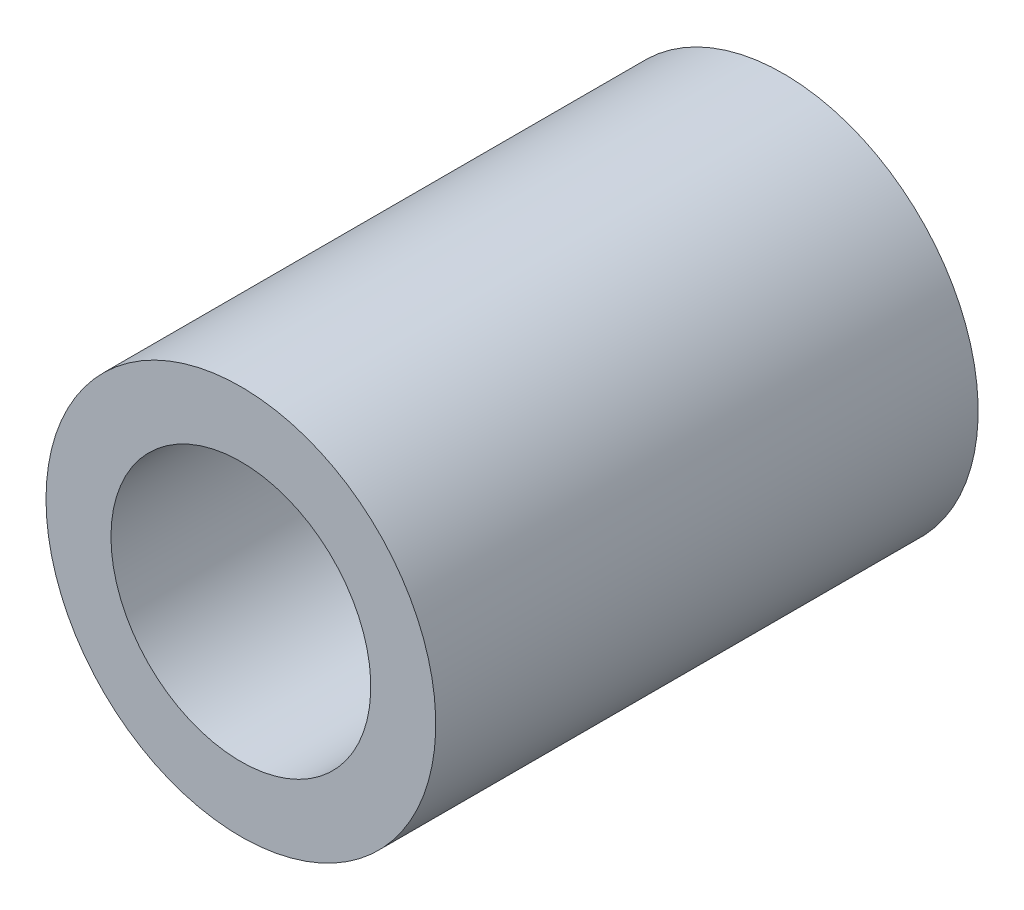
ISO-10303-21;
HEADER;
FILE_DESCRIPTION(('STEP AP214'),'2;1');
FILE_NAME('part.step','',(''),(''),'','','');
FILE_SCHEMA(('AUTOMOTIVE_DESIGN { 1 0 10303 214 1 1 1 1 }'));
ENDSEC;
DATA;
#1=APPLICATION_CONTEXT('core data for automotive mechanical design processes');
#2=APPLICATION_PROTOCOL_DEFINITION('international standard','automotive_design',2000,#1);
#3=PRODUCT_CONTEXT('',#1,'mechanical');
#4=PRODUCT('Part','Part','',(#3));
#5=PRODUCT_RELATED_PRODUCT_CATEGORY('part','',(#4));
#6=PRODUCT_DEFINITION_FORMATION('','',#4);
#7=PRODUCT_DEFINITION_CONTEXT('part definition',#1,'design');
#8=PRODUCT_DEFINITION('design','',#6,#7);
#9=PRODUCT_DEFINITION_SHAPE('','',#8);
#10=(LENGTH_UNIT() NAMED_UNIT(*) SI_UNIT(.MILLI.,.METRE.));
#11=(NAMED_UNIT(*) PLANE_ANGLE_UNIT() SI_UNIT($,.RADIAN.));
#12=(NAMED_UNIT(*) SI_UNIT($,.STERADIAN.) SOLID_ANGLE_UNIT());
#13=UNCERTAINTY_MEASURE_WITH_UNIT(LENGTH_MEASURE(1.E-05),#10,'distance_accuracy_value','');
#14=(GEOMETRIC_REPRESENTATION_CONTEXT(3) GLOBAL_UNCERTAINTY_ASSIGNED_CONTEXT((#13)) GLOBAL_UNIT_ASSIGNED_CONTEXT((#10,
#11,#12)) REPRESENTATION_CONTEXT('',''));
#15=CARTESIAN_POINT('',(0.,0.,0.));
#16=DIRECTION('',(0.,0.,1.));
#17=DIRECTION('',(1.,0.,0.));
#18=AXIS2_PLACEMENT_3D('',#15,#16,#17);
#19=CARTESIAN_POINT('',(31.63,-4.,-0.01));
#20=DIRECTION('',(0.,0.,-1.));
#21=DIRECTION('',(-1.,0.,0.));
#22=AXIS2_PLACEMENT_3D('',#19,#20,#21);
#23=CYLINDRICAL_SURFACE('',#22,0.4);
#24=CARTESIAN_POINT('',(31.63,-4.,1.66));
#25=DIRECTION('',(0.,0.,-1.));
#26=DIRECTION('',(-1.,0.,0.));
#27=AXIS2_PLACEMENT_3D('',#24,#25,#26);
#28=CIRCLE('',#27,0.4);
#29=CARTESIAN_POINT('',(31.23,-4.,1.66));
#30=VERTEX_POINT('',#29);
#31=EDGE_CURVE('E27',#30,#30,#28,.T.);
#32=ORIENTED_EDGE('',*,*,#31,.F.);
#33=EDGE_LOOP('',(#32));
#34=FACE_BOUND('',#33,.T.);
#35=CARTESIAN_POINT('',(31.63,-4.,-0.01));
#36=DIRECTION('',(0.,0.,-1.));
#37=DIRECTION('',(-1.,0.,0.));
#38=AXIS2_PLACEMENT_3D('',#35,#36,#37);
#39=CIRCLE('',#38,0.4);
#40=CARTESIAN_POINT('',(31.23,-4.,-0.01));
#41=VERTEX_POINT('',#40);
#42=EDGE_CURVE('E18',#41,#41,#39,.T.);
#43=ORIENTED_EDGE('',*,*,#42,.T.);
#44=EDGE_LOOP('',(#43));
#45=FACE_BOUND('',#44,.T.);
#46=ADVANCED_FACE('F15',(#34,#45),#23,.F.);
#47=CARTESIAN_POINT('',(31.63,-4.,-0.01));
#48=DIRECTION('',(0.,0.,1.));
#49=DIRECTION('',(1.,0.,0.));
#50=AXIS2_PLACEMENT_3D('',#47,#48,#49);
#51=PLANE('',#50);
#52=ORIENTED_EDGE('',*,*,#42,.F.);
#53=EDGE_LOOP('',(#52));
#54=FACE_BOUND('',#53,.T.);
#55=CARTESIAN_POINT('',(31.63,-4.,-0.01));
#56=DIRECTION('',(0.,0.,-1.));
#57=DIRECTION('',(-1.,0.,0.));
#58=AXIS2_PLACEMENT_3D('',#55,#56,#57);
#59=CIRCLE('',#58,0.6);
#60=CARTESIAN_POINT('',(31.03,-4.,-0.01));
#61=VERTEX_POINT('',#60);
#62=EDGE_CURVE('E22',#61,#61,#59,.F.);
#63=ORIENTED_EDGE('',*,*,#62,.F.);
#64=EDGE_LOOP('',(#63));
#65=FACE_BOUND('',#64,.T.);
#66=ADVANCED_FACE('F36',(#54,#65),#51,.F.);
#67=CARTESIAN_POINT('',(31.63,-4.,1.66));
#68=DIRECTION('',(0.,0.,1.));
#69=DIRECTION('',(1.,0.,0.));
#70=AXIS2_PLACEMENT_3D('',#67,#68,#69);
#71=PLANE('',#70);
#72=ORIENTED_EDGE('',*,*,#31,.T.);
#73=EDGE_LOOP('',(#72));
#74=FACE_BOUND('',#73,.T.);
#75=CARTESIAN_POINT('',(31.63,-4.,1.66));
#76=DIRECTION('',(0.,0.,-1.));
#77=DIRECTION('',(-1.,0.,0.));
#78=AXIS2_PLACEMENT_3D('',#75,#76,#77);
#79=CIRCLE('',#78,0.6);
#80=CARTESIAN_POINT('',(31.03,-4.,1.66));
#81=VERTEX_POINT('',#80);
#82=EDGE_CURVE('E10',#81,#81,#79,.T.);
#83=ORIENTED_EDGE('',*,*,#82,.F.);
#84=EDGE_LOOP('',(#83));
#85=FACE_BOUND('',#84,.T.);
#86=ADVANCED_FACE('F39',(#74,#85),#71,.T.);
#87=CARTESIAN_POINT('',(31.63,-4.,-0.01));
#88=DIRECTION('',(0.,0.,-1.));
#89=DIRECTION('',(-1.,0.,0.));
#90=AXIS2_PLACEMENT_3D('',#87,#88,#89);
#91=CYLINDRICAL_SURFACE('',#90,0.6);
#92=ORIENTED_EDGE('',*,*,#82,.T.);
#93=EDGE_LOOP('',(#92));
#94=FACE_BOUND('',#93,.T.);
#95=ORIENTED_EDGE('',*,*,#62,.T.);
#96=EDGE_LOOP('',(#95));
#97=FACE_BOUND('',#96,.T.);
#98=ADVANCED_FACE('F42',(#94,#97),#91,.T.);
#99=CLOSED_SHELL('',(#46,#66,#86,#98));
#100=MANIFOLD_SOLID_BREP('B1',#99);
#101=ADVANCED_BREP_SHAPE_REPRESENTATION('',(#18,#100),#14);
#102=SHAPE_DEFINITION_REPRESENTATION(#9,#101);
ENDSEC;
END-ISO-10303-21;
